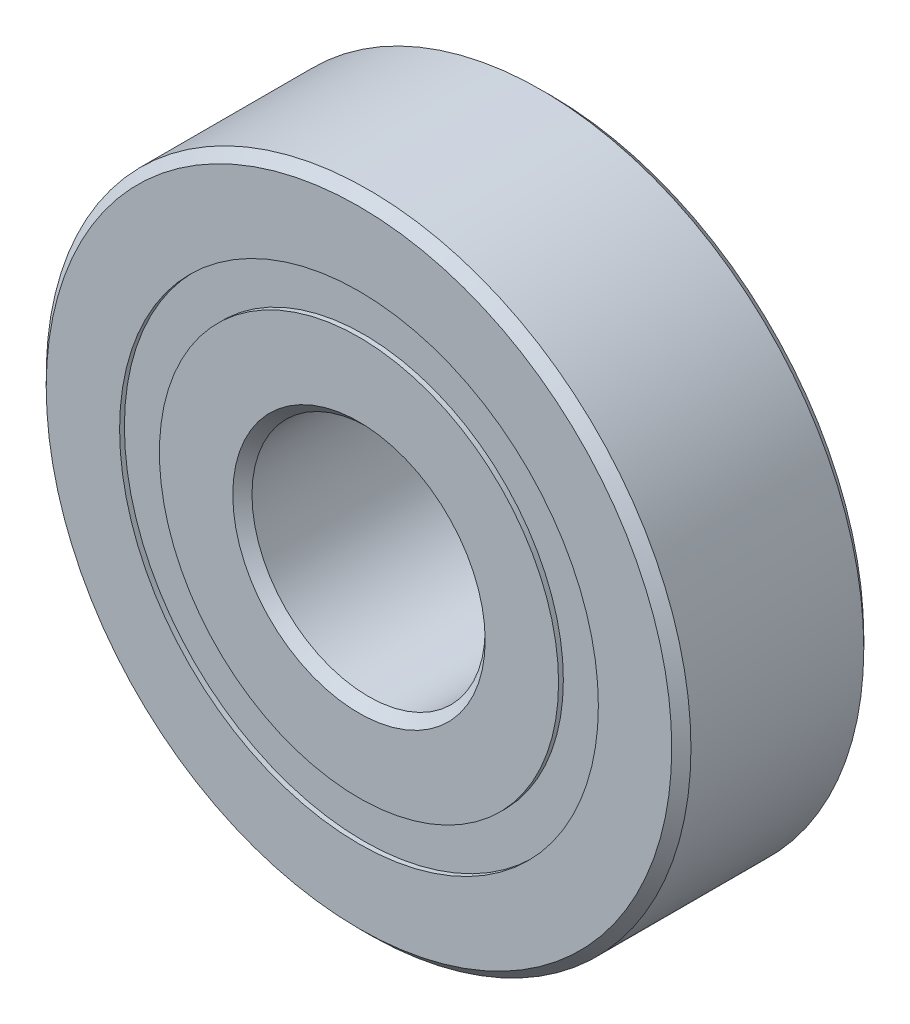
ISO-10303-21;
HEADER;
FILE_DESCRIPTION(('STEP AP214'),'2;1');
FILE_NAME('part.step','',(''),(''),'','','');
FILE_SCHEMA(('AUTOMOTIVE_DESIGN { 1 0 10303 214 1 1 1 1 }'));
ENDSEC;
DATA;
#1=APPLICATION_CONTEXT('core data for automotive mechanical design processes');
#2=APPLICATION_PROTOCOL_DEFINITION('international standard','automotive_design',2000,#1);
#3=PRODUCT_CONTEXT('',#1,'mechanical');
#4=PRODUCT('Part','Part','',(#3));
#5=PRODUCT_RELATED_PRODUCT_CATEGORY('part','',(#4));
#6=PRODUCT_DEFINITION_FORMATION('','',#4);
#7=PRODUCT_DEFINITION_CONTEXT('part definition',#1,'design');
#8=PRODUCT_DEFINITION('design','',#6,#7);
#9=PRODUCT_DEFINITION_SHAPE('','',#8);
#10=(LENGTH_UNIT() NAMED_UNIT(*) SI_UNIT(.MILLI.,.METRE.));
#11=(NAMED_UNIT(*) PLANE_ANGLE_UNIT() SI_UNIT($,.RADIAN.));
#12=(NAMED_UNIT(*) SI_UNIT($,.STERADIAN.) SOLID_ANGLE_UNIT());
#13=UNCERTAINTY_MEASURE_WITH_UNIT(LENGTH_MEASURE(1.E-05),#10,'distance_accuracy_value','');
#14=(GEOMETRIC_REPRESENTATION_CONTEXT(3) GLOBAL_UNCERTAINTY_ASSIGNED_CONTEXT((#13)) GLOBAL_UNIT_ASSIGNED_CONTEXT((#10,
#11,#12)) REPRESENTATION_CONTEXT('',''));
#15=CARTESIAN_POINT('',(0.,0.,0.));
#16=DIRECTION('',(0.,0.,1.));
#17=DIRECTION('',(1.,0.,0.));
#18=AXIS2_PLACEMENT_3D('',#15,#16,#17);
#19=CARTESIAN_POINT('',(-7.99999999999983,13.8564064605511,0.));
#20=DIRECTION('',(0.,0.,1.));
#21=DIRECTION('',(-0.499999999999989,0.866025403784445,0.));
#22=AXIS2_PLACEMENT_3D('',#19,#20,#21);
#23=SPHERICAL_SURFACE('',#22,3.43265291781274);
#24=CARTESIAN_POINT('',(-7.99999999999983,13.8564064605511,3.43265291781274));
#25=VERTEX_POINT('',#24);
#26=VERTEX_LOOP('',#25);
#27=FACE_BOUND('',#26,.T.);
#28=ADVANCED_FACE('F37',(#27),#23,.T.);
#29=CLOSED_SHELL('',(#28));
#30=MANIFOLD_SOLID_BREP('B2',#29);
#31=CARTESIAN_POINT('',(-13.8564064605509,8.00000000000017,0.));
#32=DIRECTION('',(0.,0.,1.));
#33=DIRECTION('',(-0.866025403784433,0.50000000000001,0.));
#34=AXIS2_PLACEMENT_3D('',#31,#32,#33);
#35=SPHERICAL_SURFACE('',#34,3.43265291781274);
#36=CARTESIAN_POINT('',(-13.8564064605509,8.00000000000017,3.43265291781274));
#37=VERTEX_POINT('',#36);
#38=VERTEX_LOOP('',#37);
#39=FACE_BOUND('',#38,.T.);
#40=ADVANCED_FACE('F57',(#39),#35,.T.);
#41=CLOSED_SHELL('',(#40));
#42=MANIFOLD_SOLID_BREP('B6',#41);
#43=CARTESIAN_POINT('',(-16.,1.6759110426447E-13,0.));
#44=DIRECTION('',(0.,0.,1.));
#45=DIRECTION('',(-1.,0.,0.));
#46=AXIS2_PLACEMENT_3D('',#43,#44,#45);
#47=SPHERICAL_SURFACE('',#46,3.43265291781274);
#48=CARTESIAN_POINT('',(-16.,1.6759110426447E-13,3.43265291781274));
#49=VERTEX_POINT('',#48);
#50=VERTEX_LOOP('',#49);
#51=FACE_BOUND('',#50,.T.);
#52=ADVANCED_FACE('F77',(#51),#47,.T.);
#53=CLOSED_SHELL('',(#52));
#54=MANIFOLD_SOLID_BREP('B33',#53);
#55=CARTESIAN_POINT('',(-13.8564064605511,-7.99999999999988,0.));
#56=DIRECTION('',(0.,0.,1.));
#57=DIRECTION('',(-0.866025403784443,-0.499999999999992,0.));
#58=AXIS2_PLACEMENT_3D('',#55,#56,#57);
#59=SPHERICAL_SURFACE('',#58,3.43265291781274);
#60=CARTESIAN_POINT('',(-13.8564064605511,-7.99999999999988,3.43265291781274));
#61=VERTEX_POINT('',#60);
#62=VERTEX_LOOP('',#61);
#63=FACE_BOUND('',#62,.T.);
#64=ADVANCED_FACE('F97',(#63),#59,.T.);
#65=CLOSED_SHELL('',(#64));
#66=MANIFOLD_SOLID_BREP('B53',#65);
#67=CARTESIAN_POINT('',(-8.00000000000012,-13.856406460551,0.));
#68=DIRECTION('',(0.,0.,1.));
#69=DIRECTION('',(-0.500000000000007,-0.866025403784435,0.));
#70=AXIS2_PLACEMENT_3D('',#67,#68,#69);
#71=SPHERICAL_SURFACE('',#70,3.43265291781274);
#72=CARTESIAN_POINT('',(-8.00000000000012,-13.856406460551,3.43265291781274));
#73=VERTEX_POINT('',#72);
#74=VERTEX_LOOP('',#73);
#75=FACE_BOUND('',#74,.T.);
#76=ADVANCED_FACE('F117',(#75),#71,.T.);
#77=CLOSED_SHELL('',(#76));
#78=MANIFOLD_SOLID_BREP('B73',#77);
#79=CARTESIAN_POINT('',(-1.1172740284298E-13,-16.,0.));
#80=DIRECTION('',(0.,0.,1.));
#81=DIRECTION('',(0.,-1.,0.));
#82=AXIS2_PLACEMENT_3D('',#79,#80,#81);
#83=SPHERICAL_SURFACE('',#82,3.43265291781274);
#84=CARTESIAN_POINT('',(-1.1172740284298E-13,-16.,3.43265291781274));
#85=VERTEX_POINT('',#84);
#86=VERTEX_LOOP('',#85);
#87=FACE_BOUND('',#86,.T.);
#88=ADVANCED_FACE('F137',(#87),#83,.T.);
#89=CLOSED_SHELL('',(#88));
#90=MANIFOLD_SOLID_BREP('B93',#89);
#91=CARTESIAN_POINT('',(7.99999999999992,-13.8564064605511,0.));
#92=DIRECTION('',(0.,0.,1.));
#93=DIRECTION('',(0.499999999999995,-0.866025403784442,0.));
#94=AXIS2_PLACEMENT_3D('',#91,#92,#93);
#95=SPHERICAL_SURFACE('',#94,3.43265291781274);
#96=CARTESIAN_POINT('',(7.99999999999992,-13.8564064605511,3.43265291781274));
#97=VERTEX_POINT('',#96);
#98=VERTEX_LOOP('',#97);
#99=FACE_BOUND('',#98,.T.);
#100=ADVANCED_FACE('F157',(#99),#95,.T.);
#101=CLOSED_SHELL('',(#100));
#102=MANIFOLD_SOLID_BREP('B113',#101);
#103=CARTESIAN_POINT('',(13.856406460551,-8.00000000000007,0.));
#104=DIRECTION('',(0.,0.,1.));
#105=DIRECTION('',(0.866025403784436,-0.500000000000004,0.));
#106=AXIS2_PLACEMENT_3D('',#103,#104,#105);
#107=SPHERICAL_SURFACE('',#106,3.43265291781274);
#108=CARTESIAN_POINT('',(13.856406460551,-8.00000000000007,3.43265291781274));
#109=VERTEX_POINT('',#108);
#110=VERTEX_LOOP('',#109);
#111=FACE_BOUND('',#110,.T.);
#112=ADVANCED_FACE('F177',(#111),#107,.T.);
#113=CLOSED_SHELL('',(#112));
#114=MANIFOLD_SOLID_BREP('B133',#113);
#115=CARTESIAN_POINT('',(16.,0.,0.));
#116=DIRECTION('',(0.,0.,1.));
#117=DIRECTION('',(1.,0.,0.));
#118=AXIS2_PLACEMENT_3D('',#115,#116,#117);
#119=SPHERICAL_SURFACE('',#118,3.43265291781274);
#120=CARTESIAN_POINT('',(16.,0.,3.43265291781274));
#121=VERTEX_POINT('',#120);
#122=VERTEX_LOOP('',#121);
#123=FACE_BOUND('',#122,.T.);
#124=ADVANCED_FACE('F197',(#123),#119,.T.);
#125=CLOSED_SHELL('',(#124));
#126=MANIFOLD_SOLID_BREP('B153',#125);
#127=CARTESIAN_POINT('',(13.856406460551,7.99999999999997,0.));
#128=DIRECTION('',(0.,0.,1.));
#129=DIRECTION('',(0.86602540378444,0.499999999999998,0.));
#130=AXIS2_PLACEMENT_3D('',#127,#128,#129);
#131=SPHERICAL_SURFACE('',#130,3.43265291781274);
#132=CARTESIAN_POINT('',(13.856406460551,7.99999999999997,3.43265291781274));
#133=VERTEX_POINT('',#132);
#134=VERTEX_LOOP('',#133);
#135=FACE_BOUND('',#134,.T.);
#136=ADVANCED_FACE('F217',(#135),#131,.T.);
#137=CLOSED_SHELL('',(#136));
#138=MANIFOLD_SOLID_BREP('B173',#137);
#139=CARTESIAN_POINT('',(8.00000000000002,13.856406460551,0.));
#140=DIRECTION('',(0.,0.,1.));
#141=DIRECTION('',(0.500000000000001,0.866025403784438,0.));
#142=AXIS2_PLACEMENT_3D('',#139,#140,#141);
#143=SPHERICAL_SURFACE('',#142,3.43265291781274);
#144=CARTESIAN_POINT('',(8.00000000000002,13.856406460551,3.43265291781274));
#145=VERTEX_POINT('',#144);
#146=VERTEX_LOOP('',#145);
#147=FACE_BOUND('',#146,.T.);
#148=ADVANCED_FACE('F237',(#147),#143,.T.);
#149=CLOSED_SHELL('',(#148));
#150=MANIFOLD_SOLID_BREP('B193',#149);
#151=CARTESIAN_POINT('',(0.,16.,0.));
#152=DIRECTION('',(0.,0.,1.));
#153=DIRECTION('',(0.,1.,0.));
#154=AXIS2_PLACEMENT_3D('',#151,#152,#153);
#155=SPHERICAL_SURFACE('',#154,3.43265291781274);
#156=CARTESIAN_POINT('',(0.,16.,3.43265291781274));
#157=VERTEX_POINT('',#156);
#158=VERTEX_LOOP('',#157);
#159=FACE_BOUND('',#158,.T.);
#160=ADVANCED_FACE('F258',(#159),#155,.T.);
#161=CLOSED_SHELL('',(#160));
#162=MANIFOLD_SOLID_BREP('B213',#161);
#163=CARTESIAN_POINT('',(0.,0.,7.));
#164=DIRECTION('',(0.,0.,1.));
#165=DIRECTION('',(1.,0.,0.));
#166=AXIS2_PLACEMENT_3D('',#163,#164,#165);
#167=CYLINDRICAL_SURFACE('',#166,17.4505494505495);
#168=CARTESIAN_POINT('',(0.,0.,-7.));
#169=DIRECTION('',(0.,0.,1.));
#170=DIRECTION('',(1.,0.,0.));
#171=AXIS2_PLACEMENT_3D('',#168,#169,#170);
#172=CIRCLE('',#171,17.4505494505495);
#173=CARTESIAN_POINT('',(17.4505494505495,0.,-7.));
#174=VERTEX_POINT('',#173);
#175=EDGE_CURVE('E310',#174,#174,#172,.T.);
#176=ORIENTED_EDGE('',*,*,#175,.F.);
#177=EDGE_LOOP('',(#176));
#178=FACE_BOUND('',#177,.T.);
#179=CARTESIAN_POINT('',(0.,0.,-6.64999999999999));
#180=DIRECTION('',(0.,0.,1.));
#181=DIRECTION('',(1.,0.,0.));
#182=AXIS2_PLACEMENT_3D('',#179,#180,#181);
#183=CIRCLE('',#182,17.4505494505495);
#184=CARTESIAN_POINT('',(17.4505494505495,0.,-6.64999999999999));
#185=VERTEX_POINT('',#184);
#186=EDGE_CURVE('E257',#185,#185,#183,.F.);
#187=ORIENTED_EDGE('',*,*,#186,.F.);
#188=EDGE_LOOP('',(#187));
#189=FACE_BOUND('',#188,.T.);
#190=ADVANCED_FACE('F271',(#178,#189),#167,.F.);
#191=CARTESIAN_POINT('',(0.,0.,7.));
#192=DIRECTION('',(0.,0.,1.));
#193=DIRECTION('',(1.,0.,0.));
#194=AXIS2_PLACEMENT_3D('',#191,#192,#193);
#195=CYLINDRICAL_SURFACE('',#194,14.5494505494506);
#196=CARTESIAN_POINT('',(0.,0.,-7.));
#197=DIRECTION('',(0.,0.,1.));
#198=DIRECTION('',(1.,0.,0.));
#199=AXIS2_PLACEMENT_3D('',#196,#197,#198);
#200=CIRCLE('',#199,14.5494505494506);
#201=CARTESIAN_POINT('',(14.5494505494506,0.,-7.));
#202=VERTEX_POINT('',#201);
#203=EDGE_CURVE('E337',#202,#202,#200,.T.);
#204=ORIENTED_EDGE('',*,*,#203,.T.);
#205=EDGE_LOOP('',(#204));
#206=FACE_BOUND('',#205,.T.);
#207=CARTESIAN_POINT('',(0.,0.,-6.64999999999999));
#208=DIRECTION('',(0.,0.,1.));
#209=DIRECTION('',(1.,0.,0.));
#210=AXIS2_PLACEMENT_3D('',#207,#208,#209);
#211=CIRCLE('',#210,14.5494505494506);
#212=CARTESIAN_POINT('',(14.5494505494506,0.,-6.64999999999999));
#213=VERTEX_POINT('',#212);
#214=EDGE_CURVE('E283',#213,#213,#211,.T.);
#215=ORIENTED_EDGE('',*,*,#214,.F.);
#216=EDGE_LOOP('',(#215));
#217=FACE_BOUND('',#216,.T.);
#218=ADVANCED_FACE('F379',(#206,#217),#195,.T.);
#219=CARTESIAN_POINT('',(0.,0.,7.));
#220=DIRECTION('',(0.,0.,1.));
#221=DIRECTION('',(1.,0.,0.));
#222=AXIS2_PLACEMENT_3D('',#219,#220,#221);
#223=CYLINDRICAL_SURFACE('',#222,17.4505494505495);
#224=CARTESIAN_POINT('',(0.,0.,7.));
#225=DIRECTION('',(0.,0.,1.));
#226=DIRECTION('',(1.,0.,0.));
#227=AXIS2_PLACEMENT_3D('',#224,#225,#226);
#228=CIRCLE('',#227,17.4505494505495);
#229=CARTESIAN_POINT('',(17.4505494505495,0.,7.));
#230=VERTEX_POINT('',#229);
#231=EDGE_CURVE('E301',#230,#230,#228,.T.);
#232=ORIENTED_EDGE('',*,*,#231,.T.);
#233=EDGE_LOOP('',(#232));
#234=FACE_BOUND('',#233,.T.);
#235=CARTESIAN_POINT('',(0.,0.,6.64999999999999));
#236=DIRECTION('',(0.,0.,-1.));
#237=DIRECTION('',(-1.,0.,0.));
#238=AXIS2_PLACEMENT_3D('',#235,#236,#237);
#239=CIRCLE('',#238,17.4505494505495);
#240=CARTESIAN_POINT('',(-17.4505494505495,0.,6.64999999999999));
#241=VERTEX_POINT('',#240);
#242=EDGE_CURVE('E292',#241,#241,#239,.F.);
#243=ORIENTED_EDGE('',*,*,#242,.F.);
#244=EDGE_LOOP('',(#243));
#245=FACE_BOUND('',#244,.T.);
#246=ADVANCED_FACE('F377',(#234,#245),#223,.F.);
#247=CARTESIAN_POINT('',(0.,0.,6.29999999999999));
#248=DIRECTION('',(0.,0.,-1.));
#249=DIRECTION('',(-1.,0.,0.));
#250=AXIS2_PLACEMENT_3D('',#247,#248,#249);
#251=CONICAL_SURFACE('',#250,23.5,0.785398163397448);
#252=CARTESIAN_POINT('',(0.,0.,7.));
#253=DIRECTION('',(0.,0.,1.));
#254=DIRECTION('',(1.,0.,0.));
#255=AXIS2_PLACEMENT_3D('',#252,#253,#254);
#256=CIRCLE('',#255,22.8);
#257=CARTESIAN_POINT('',(22.8,0.,7.));
#258=VERTEX_POINT('',#257);
#259=EDGE_CURVE('E298',#258,#258,#256,.T.);
#260=ORIENTED_EDGE('',*,*,#259,.F.);
#261=EDGE_LOOP('',(#260));
#262=FACE_BOUND('',#261,.T.);
#263=CARTESIAN_POINT('',(0.,0.,6.29999999999999));
#264=DIRECTION('',(0.,0.,1.));
#265=DIRECTION('',(1.,0.,0.));
#266=AXIS2_PLACEMENT_3D('',#263,#264,#265);
#267=CIRCLE('',#266,23.5);
#268=CARTESIAN_POINT('',(23.5,0.,6.29999999999999));
#269=VERTEX_POINT('',#268);
#270=EDGE_CURVE('E319',#269,#269,#267,.T.);
#271=ORIENTED_EDGE('',*,*,#270,.T.);
#272=EDGE_LOOP('',(#271));
#273=FACE_BOUND('',#272,.T.);
#274=ADVANCED_FACE('F273',(#262,#273),#251,.T.);
#275=CARTESIAN_POINT('',(0.,22.8,7.));
#276=DIRECTION('',(0.,0.,-1.));
#277=DIRECTION('',(-1.,0.,0.));
#278=AXIS2_PLACEMENT_3D('',#275,#276,#277);
#279=PLANE('',#278);
#280=ORIENTED_EDGE('',*,*,#231,.F.);
#281=EDGE_LOOP('',(#280));
#282=FACE_BOUND('',#281,.T.);
#283=ORIENTED_EDGE('',*,*,#259,.T.);
#284=EDGE_LOOP('',(#283));
#285=FACE_BOUND('',#284,.T.);
#286=ADVANCED_FACE('F387',(#282,#285),#279,.F.);
#287=CARTESIAN_POINT('',(0.,22.8,-7.));
#288=DIRECTION('',(0.,0.,1.));
#289=DIRECTION('',(1.,0.,0.));
#290=AXIS2_PLACEMENT_3D('',#287,#288,#289);
#291=PLANE('',#290);
#292=CARTESIAN_POINT('',(0.,0.,-7.));
#293=DIRECTION('',(0.,0.,1.));
#294=DIRECTION('',(1.,0.,0.));
#295=AXIS2_PLACEMENT_3D('',#292,#293,#294);
#296=CIRCLE('',#295,22.8);
#297=CARTESIAN_POINT('',(22.8,0.,-7.));
#298=VERTEX_POINT('',#297);
#299=EDGE_CURVE('E313',#298,#298,#296,.T.);
#300=ORIENTED_EDGE('',*,*,#299,.F.);
#301=EDGE_LOOP('',(#300));
#302=FACE_BOUND('',#301,.T.);
#303=ORIENTED_EDGE('',*,*,#175,.T.);
#304=EDGE_LOOP('',(#303));
#305=FACE_BOUND('',#304,.T.);
#306=ADVANCED_FACE('F449',(#302,#305),#291,.F.);
#307=CARTESIAN_POINT('',(0.,0.,-7.));
#308=DIRECTION('',(0.,0.,1.));
#309=DIRECTION('',(1.,0.,0.));
#310=AXIS2_PLACEMENT_3D('',#307,#308,#309);
#311=CONICAL_SURFACE('',#310,22.8,0.785398163397442);
#312=CARTESIAN_POINT('',(0.,0.,-6.29999999999999));
#313=DIRECTION('',(0.,0.,1.));
#314=DIRECTION('',(1.,0.,0.));
#315=AXIS2_PLACEMENT_3D('',#312,#313,#314);
#316=CIRCLE('',#315,23.5);
#317=CARTESIAN_POINT('',(23.5,0.,-6.29999999999999));
#318=VERTEX_POINT('',#317);
#319=EDGE_CURVE('E316',#318,#318,#316,.T.);
#320=ORIENTED_EDGE('',*,*,#319,.F.);
#321=EDGE_LOOP('',(#320));
#322=FACE_BOUND('',#321,.T.);
#323=ORIENTED_EDGE('',*,*,#299,.T.);
#324=EDGE_LOOP('',(#323));
#325=FACE_BOUND('',#324,.T.);
#326=ADVANCED_FACE('F446',(#322,#325),#311,.T.);
#327=CARTESIAN_POINT('',(0.,0.,7.));
#328=DIRECTION('',(0.,0.,1.));
#329=DIRECTION('',(1.,0.,0.));
#330=AXIS2_PLACEMENT_3D('',#327,#328,#329);
#331=CYLINDRICAL_SURFACE('',#330,23.5);
#332=ORIENTED_EDGE('',*,*,#270,.F.);
#333=EDGE_LOOP('',(#332));
#334=FACE_BOUND('',#333,.T.);
#335=ORIENTED_EDGE('',*,*,#319,.T.);
#336=EDGE_LOOP('',(#335));
#337=FACE_BOUND('',#336,.T.);
#338=ADVANCED_FACE('F373',(#334,#337),#331,.T.);
#339=CARTESIAN_POINT('',(0.,17.4505494505495,6.64999999999999));
#340=DIRECTION('',(0.,0.,-1.));
#341=DIRECTION('',(-1.,0.,0.));
#342=AXIS2_PLACEMENT_3D('',#339,#340,#341);
#343=PLANE('',#342);
#344=CARTESIAN_POINT('',(0.,0.,6.64999999999999));
#345=DIRECTION('',(0.,0.,1.));
#346=DIRECTION('',(1.,0.,0.));
#347=AXIS2_PLACEMENT_3D('',#344,#345,#346);
#348=CIRCLE('',#347,14.5494505494506);
#349=CARTESIAN_POINT('',(14.5494505494506,0.,6.64999999999999));
#350=VERTEX_POINT('',#349);
#351=EDGE_CURVE('E322',#350,#350,#348,.T.);
#352=ORIENTED_EDGE('',*,*,#351,.F.);
#353=EDGE_LOOP('',(#352));
#354=FACE_BOUND('',#353,.T.);
#355=ORIENTED_EDGE('',*,*,#242,.T.);
#356=EDGE_LOOP('',(#355));
#357=FACE_BOUND('',#356,.T.);
#358=ADVANCED_FACE('F366',(#354,#357),#343,.F.);
#359=CARTESIAN_POINT('',(0.,0.,7.));
#360=DIRECTION('',(0.,0.,1.));
#361=DIRECTION('',(1.,0.,0.));
#362=AXIS2_PLACEMENT_3D('',#359,#360,#361);
#363=CYLINDRICAL_SURFACE('',#362,14.5494505494506);
#364=CARTESIAN_POINT('',(0.,0.,7.));
#365=DIRECTION('',(0.,0.,1.));
#366=DIRECTION('',(1.,0.,0.));
#367=AXIS2_PLACEMENT_3D('',#364,#365,#366);
#368=CIRCLE('',#367,14.5494505494506);
#369=CARTESIAN_POINT('',(14.5494505494506,0.,7.));
#370=VERTEX_POINT('',#369);
#371=EDGE_CURVE('E346',#370,#370,#368,.T.);
#372=ORIENTED_EDGE('',*,*,#371,.F.);
#373=EDGE_LOOP('',(#372));
#374=FACE_BOUND('',#373,.T.);
#375=ORIENTED_EDGE('',*,*,#351,.T.);
#376=EDGE_LOOP('',(#375));
#377=FACE_BOUND('',#376,.T.);
#378=ADVANCED_FACE('F363',(#374,#377),#363,.T.);
#379=CARTESIAN_POINT('',(0.,0.,7.));
#380=DIRECTION('',(0.,0.,1.));
#381=DIRECTION('',(1.,0.,0.));
#382=AXIS2_PLACEMENT_3D('',#379,#380,#381);
#383=CONICAL_SURFACE('',#382,9.20000000000001,0.785398163397447);
#384=CARTESIAN_POINT('',(0.,0.,6.3));
#385=DIRECTION('',(0.,0.,1.));
#386=DIRECTION('',(1.,0.,0.));
#387=AXIS2_PLACEMENT_3D('',#384,#385,#386);
#388=CIRCLE('',#387,8.50000000000001);
#389=CARTESIAN_POINT('',(8.50000000000001,0.,6.3));
#390=VERTEX_POINT('',#389);
#391=EDGE_CURVE('E328',#390,#390,#388,.T.);
#392=ORIENTED_EDGE('',*,*,#391,.F.);
#393=EDGE_LOOP('',(#392));
#394=FACE_BOUND('',#393,.T.);
#395=CARTESIAN_POINT('',(0.,0.,7.));
#396=DIRECTION('',(0.,0.,1.));
#397=DIRECTION('',(1.,0.,0.));
#398=AXIS2_PLACEMENT_3D('',#395,#396,#397);
#399=CIRCLE('',#398,9.20000000000001);
#400=CARTESIAN_POINT('',(9.20000000000001,0.,7.));
#401=VERTEX_POINT('',#400);
#402=EDGE_CURVE('E349',#401,#401,#399,.T.);
#403=ORIENTED_EDGE('',*,*,#402,.T.);
#404=EDGE_LOOP('',(#403));
#405=FACE_BOUND('',#404,.T.);
#406=ADVANCED_FACE('F353',(#394,#405),#383,.F.);
#407=CARTESIAN_POINT('',(0.,0.,7.));
#408=DIRECTION('',(0.,0.,1.));
#409=DIRECTION('',(1.,0.,0.));
#410=AXIS2_PLACEMENT_3D('',#407,#408,#409);
#411=CYLINDRICAL_SURFACE('',#410,8.50000000000001);
#412=CARTESIAN_POINT('',(0.,0.,-6.3));
#413=DIRECTION('',(0.,0.,1.));
#414=DIRECTION('',(1.,0.,0.));
#415=AXIS2_PLACEMENT_3D('',#412,#413,#414);
#416=CIRCLE('',#415,8.50000000000001);
#417=CARTESIAN_POINT('',(8.50000000000001,0.,-6.3));
#418=VERTEX_POINT('',#417);
#419=EDGE_CURVE('E331',#418,#418,#416,.T.);
#420=ORIENTED_EDGE('',*,*,#419,.F.);
#421=EDGE_LOOP('',(#420));
#422=FACE_BOUND('',#421,.T.);
#423=ORIENTED_EDGE('',*,*,#391,.T.);
#424=EDGE_LOOP('',(#423));
#425=FACE_BOUND('',#424,.T.);
#426=ADVANCED_FACE('F436',(#422,#425),#411,.F.);
#427=CARTESIAN_POINT('',(0.,0.,-6.3));
#428=DIRECTION('',(0.,0.,-1.));
#429=DIRECTION('',(-1.,0.,0.));
#430=AXIS2_PLACEMENT_3D('',#427,#428,#429);
#431=CONICAL_SURFACE('',#430,8.50000000000001,0.785398163397447);
#432=CARTESIAN_POINT('',(0.,0.,-7.));
#433=DIRECTION('',(0.,0.,1.));
#434=DIRECTION('',(1.,0.,0.));
#435=AXIS2_PLACEMENT_3D('',#432,#433,#434);
#436=CIRCLE('',#435,9.20000000000001);
#437=CARTESIAN_POINT('',(9.20000000000001,0.,-7.));
#438=VERTEX_POINT('',#437);
#439=EDGE_CURVE('E334',#438,#438,#436,.T.);
#440=ORIENTED_EDGE('',*,*,#439,.F.);
#441=EDGE_LOOP('',(#440));
#442=FACE_BOUND('',#441,.T.);
#443=ORIENTED_EDGE('',*,*,#419,.T.);
#444=EDGE_LOOP('',(#443));
#445=FACE_BOUND('',#444,.T.);
#446=ADVANCED_FACE('F432',(#442,#445),#431,.F.);
#447=CARTESIAN_POINT('',(0.,9.20000000000001,-7.));
#448=DIRECTION('',(0.,0.,1.));
#449=DIRECTION('',(1.,0.,0.));
#450=AXIS2_PLACEMENT_3D('',#447,#448,#449);
#451=PLANE('',#450);
#452=ORIENTED_EDGE('',*,*,#203,.F.);
#453=EDGE_LOOP('',(#452));
#454=FACE_BOUND('',#453,.T.);
#455=ORIENTED_EDGE('',*,*,#439,.T.);
#456=EDGE_LOOP('',(#455));
#457=FACE_BOUND('',#456,.T.);
#458=ADVANCED_FACE('F359',(#454,#457),#451,.F.);
#459=CARTESIAN_POINT('',(0.,9.20000000000001,7.));
#460=DIRECTION('',(0.,0.,-1.));
#461=DIRECTION('',(-1.,0.,0.));
#462=AXIS2_PLACEMENT_3D('',#459,#460,#461);
#463=PLANE('',#462);
#464=ORIENTED_EDGE('',*,*,#402,.F.);
#465=EDGE_LOOP('',(#464));
#466=FACE_BOUND('',#465,.T.);
#467=ORIENTED_EDGE('',*,*,#371,.T.);
#468=EDGE_LOOP('',(#467));
#469=FACE_BOUND('',#468,.T.);
#470=ADVANCED_FACE('F355',(#466,#469),#463,.F.);
#471=CARTESIAN_POINT('',(0.,17.4505494505495,-6.64999999999999));
#472=DIRECTION('',(0.,0.,1.));
#473=DIRECTION('',(1.,0.,0.));
#474=AXIS2_PLACEMENT_3D('',#471,#472,#473);
#475=PLANE('',#474);
#476=ORIENTED_EDGE('',*,*,#186,.T.);
#477=EDGE_LOOP('',(#476));
#478=FACE_BOUND('',#477,.T.);
#479=ORIENTED_EDGE('',*,*,#214,.T.);
#480=EDGE_LOOP('',(#479));
#481=FACE_BOUND('',#480,.T.);
#482=ADVANCED_FACE('F358',(#478,#481),#475,.F.);
#483=CLOSED_SHELL('',(#190,#218,#246,#274,#286,#306,#326,#338,#358,#378,#406,#426,#446,#458,
#470,#482));
#484=CARTESIAN_POINT('',(0.,17.4505494505495,-3.43265291781274));
#485=DIRECTION('',(0.,0.,-1.));
#486=DIRECTION('',(-1.,0.,0.));
#487=AXIS2_PLACEMENT_3D('',#484,#485,#486);
#488=PLANE('',#487);
#489=CARTESIAN_POINT('',(0.,0.,-3.43265291781274));
#490=DIRECTION('',(0.,0.,-1.));
#491=DIRECTION('',(-1.,0.,0.));
#492=AXIS2_PLACEMENT_3D('',#489,#490,#491);
#493=CIRCLE('',#492,14.5494505494506);
#494=CARTESIAN_POINT('',(-14.5494505494506,0.,-3.43265291781274));
#495=VERTEX_POINT('',#494);
#496=EDGE_CURVE('E287',#495,#495,#493,.T.);
#497=ORIENTED_EDGE('',*,*,#496,.T.);
#498=EDGE_LOOP('',(#497));
#499=FACE_BOUND('',#498,.T.);
#500=CARTESIAN_POINT('',(0.,0.,-3.43265291781274));
#501=DIRECTION('',(0.,0.,-1.));
#502=DIRECTION('',(-1.,0.,0.));
#503=AXIS2_PLACEMENT_3D('',#500,#501,#502);
#504=CIRCLE('',#503,17.4505494505495);
#505=CARTESIAN_POINT('',(-17.4505494505495,0.,-3.43265291781274));
#506=VERTEX_POINT('',#505);
#507=EDGE_CURVE('E279',#506,#506,#504,.F.);
#508=ORIENTED_EDGE('',*,*,#507,.T.);
#509=EDGE_LOOP('',(#508));
#510=FACE_BOUND('',#509,.T.);
#511=ADVANCED_FACE('F395',(#499,#510),#488,.F.);
#512=CARTESIAN_POINT('',(0.,0.,3.11111111111111));
#513=DIRECTION('',(0.,0.,1.));
#514=DIRECTION('',(1.,0.,0.));
#515=AXIS2_PLACEMENT_3D('',#512,#513,#514);
#516=CIRCLE('',#515,17.4505494505495);
#517=CARTESIAN_POINT('',(17.4505494505495,0.,3.11111111111111));
#518=VERTEX_POINT('',#517);
#519=EDGE_CURVE('E304',#518,#518,#516,.T.);
#520=ORIENTED_EDGE('',*,*,#519,.F.);
#521=EDGE_LOOP('',(#520));
#522=FACE_BOUND('',#521,.T.);
#523=CARTESIAN_POINT('',(0.,0.,3.43265291781274));
#524=DIRECTION('',(0.,0.,1.));
#525=DIRECTION('',(1.,0.,0.));
#526=AXIS2_PLACEMENT_3D('',#523,#524,#525);
#527=CIRCLE('',#526,17.4505494505495);
#528=CARTESIAN_POINT('',(17.4505494505495,0.,3.43265291781274));
#529=VERTEX_POINT('',#528);
#530=EDGE_CURVE('E295',#529,#529,#527,.F.);
#531=ORIENTED_EDGE('',*,*,#530,.F.);
#532=EDGE_LOOP('',(#531));
#533=FACE_BOUND('',#532,.T.);
#534=ADVANCED_FACE('F382',(#522,#533),#223,.F.);
#535=CARTESIAN_POINT('',(0.,0.,0.));
#536=DIRECTION('',(0.,0.,1.));
#537=DIRECTION('',(1.,0.,0.));
#538=AXIS2_PLACEMENT_3D('',#535,#536,#537);
#539=TOROIDAL_SURFACE('',#538,16.,3.43265291781274);
#540=CARTESIAN_POINT('',(0.,0.,-3.11111111111111));
#541=DIRECTION('',(0.,0.,1.));
#542=DIRECTION('',(1.,0.,0.));
#543=AXIS2_PLACEMENT_3D('',#540,#541,#542);
#544=CIRCLE('',#543,17.4505494505495);
#545=CARTESIAN_POINT('',(17.4505494505495,0.,-3.11111111111111));
#546=VERTEX_POINT('',#545);
#547=EDGE_CURVE('E307',#546,#546,#544,.T.);
#548=ORIENTED_EDGE('',*,*,#547,.F.);
#549=EDGE_LOOP('',(#548));
#550=FACE_BOUND('',#549,.T.);
#551=ORIENTED_EDGE('',*,*,#519,.T.);
#552=EDGE_LOOP('',(#551));
#553=FACE_BOUND('',#552,.T.);
#554=ADVANCED_FACE('F394',(#550,#553),#539,.F.);
#555=ORIENTED_EDGE('',*,*,#547,.T.);
#556=EDGE_LOOP('',(#555));
#557=FACE_BOUND('',#556,.T.);
#558=ORIENTED_EDGE('',*,*,#507,.F.);
#559=EDGE_LOOP('',(#558));
#560=FACE_BOUND('',#559,.T.);
#561=ADVANCED_FACE('F401',(#557,#560),#167,.F.);
#562=CARTESIAN_POINT('',(0.,17.4505494505495,3.43265291781274));
#563=DIRECTION('',(0.,0.,1.));
#564=DIRECTION('',(1.,0.,0.));
#565=AXIS2_PLACEMENT_3D('',#562,#563,#564);
#566=PLANE('',#565);
#567=ORIENTED_EDGE('',*,*,#530,.T.);
#568=EDGE_LOOP('',(#567));
#569=FACE_BOUND('',#568,.T.);
#570=CARTESIAN_POINT('',(0.,0.,3.43265291781274));
#571=DIRECTION('',(0.,0.,1.));
#572=DIRECTION('',(1.,0.,0.));
#573=AXIS2_PLACEMENT_3D('',#570,#571,#572);
#574=CIRCLE('',#573,14.5494505494506);
#575=CARTESIAN_POINT('',(14.5494505494506,0.,3.43265291781274));
#576=VERTEX_POINT('',#575);
#577=EDGE_CURVE('E325',#576,#576,#574,.F.);
#578=ORIENTED_EDGE('',*,*,#577,.F.);
#579=EDGE_LOOP('',(#578));
#580=FACE_BOUND('',#579,.T.);
#581=ADVANCED_FACE('F408',(#569,#580),#566,.F.);
#582=CARTESIAN_POINT('',(0.,0.,3.11111111111111));
#583=DIRECTION('',(0.,0.,1.));
#584=DIRECTION('',(1.,0.,0.));
#585=AXIS2_PLACEMENT_3D('',#582,#583,#584);
#586=CIRCLE('',#585,14.5494505494506);
#587=CARTESIAN_POINT('',(14.5494505494506,0.,3.11111111111111));
#588=VERTEX_POINT('',#587);
#589=EDGE_CURVE('E343',#588,#588,#586,.T.);
#590=ORIENTED_EDGE('',*,*,#589,.T.);
#591=EDGE_LOOP('',(#590));
#592=FACE_BOUND('',#591,.T.);
#593=ORIENTED_EDGE('',*,*,#577,.T.);
#594=EDGE_LOOP('',(#593));
#595=FACE_BOUND('',#594,.T.);
#596=ADVANCED_FACE('F368',(#592,#595),#363,.T.);
#597=CARTESIAN_POINT('',(0.,0.,0.));
#598=DIRECTION('',(0.,0.,1.));
#599=DIRECTION('',(1.,0.,0.));
#600=AXIS2_PLACEMENT_3D('',#597,#598,#599);
#601=TOROIDAL_SURFACE('',#600,16.,3.43265291781274);
#602=ORIENTED_EDGE('',*,*,#589,.F.);
#603=EDGE_LOOP('',(#602));
#604=FACE_BOUND('',#603,.T.);
#605=CARTESIAN_POINT('',(0.,0.,-3.11111111111111));
#606=DIRECTION('',(0.,0.,1.));
#607=DIRECTION('',(1.,0.,0.));
#608=AXIS2_PLACEMENT_3D('',#605,#606,#607);
#609=CIRCLE('',#608,14.5494505494506);
#610=CARTESIAN_POINT('',(14.5494505494506,0.,-3.11111111111111));
#611=VERTEX_POINT('',#610);
#612=EDGE_CURVE('E340',#611,#611,#609,.T.);
#613=ORIENTED_EDGE('',*,*,#612,.T.);
#614=EDGE_LOOP('',(#613));
#615=FACE_BOUND('',#614,.T.);
#616=ADVANCED_FACE('F426',(#604,#615),#601,.F.);
#617=ORIENTED_EDGE('',*,*,#612,.F.);
#618=EDGE_LOOP('',(#617));
#619=FACE_BOUND('',#618,.T.);
#620=ORIENTED_EDGE('',*,*,#496,.F.);
#621=EDGE_LOOP('',(#620));
#622=FACE_BOUND('',#621,.T.);
#623=ADVANCED_FACE('F391',(#619,#622),#195,.T.);
#624=CLOSED_SHELL('',(#511,#534,#554,#561,#581,#596,#616,#623));
#625=ORIENTED_CLOSED_SHELL('',*,#624,.T.);
#626=BREP_WITH_VOIDS('B233',#483,(#625));
#627=ADVANCED_BREP_SHAPE_REPRESENTATION('',(#18,#30,#42,#54,#66,#78,#90,#102,#114,#126,#138,
#150,#162,#626),#14);
#628=SHAPE_DEFINITION_REPRESENTATION(#9,#627);
ENDSEC;
END-ISO-10303-21;
